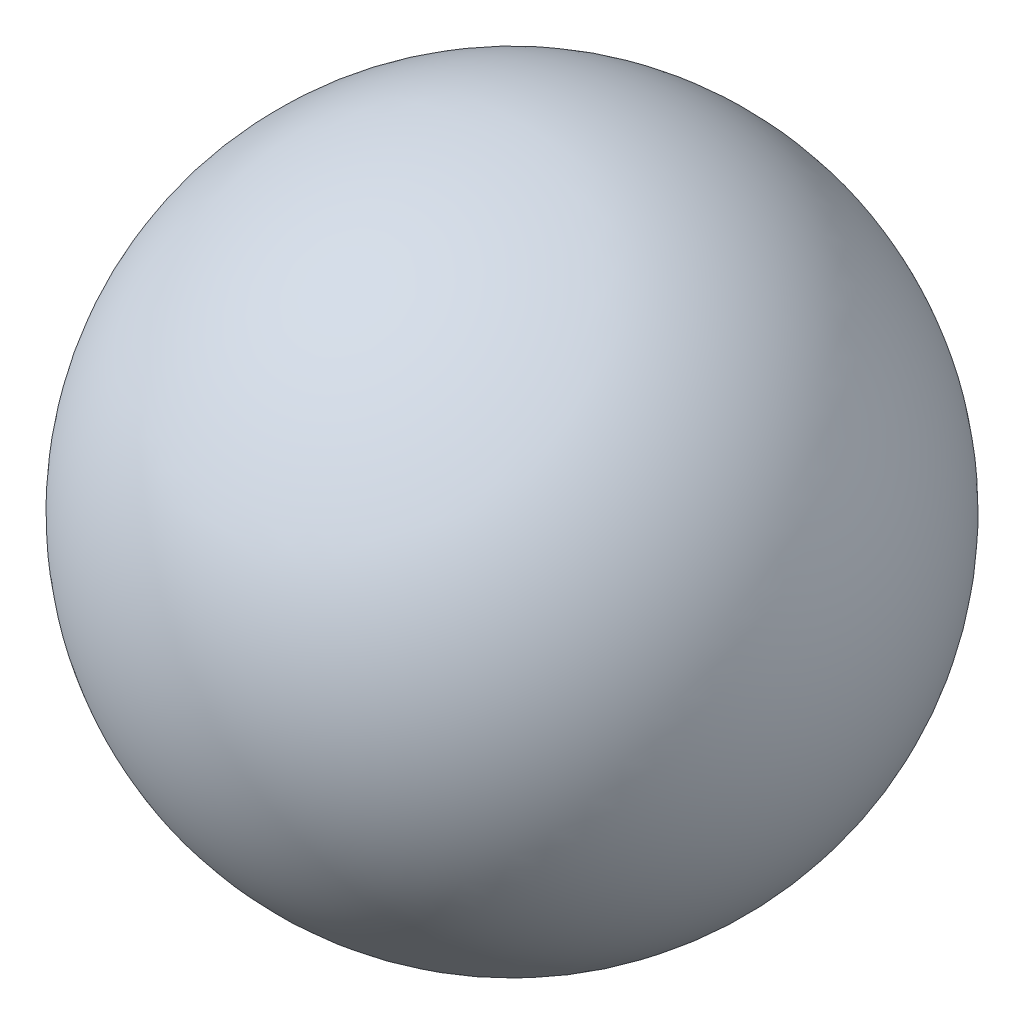
ISO-10303-21;
HEADER;
FILE_DESCRIPTION(('STEP AP214'),'2;1');
FILE_NAME('part.step','',(''),(''),'','','');
FILE_SCHEMA(('AUTOMOTIVE_DESIGN { 1 0 10303 214 1 1 1 1 }'));
ENDSEC;
DATA;
#1=APPLICATION_CONTEXT('core data for automotive mechanical design processes');
#2=APPLICATION_PROTOCOL_DEFINITION('international standard','automotive_design',2000,#1);
#3=PRODUCT_CONTEXT('',#1,'mechanical');
#4=PRODUCT('Part','Part','',(#3));
#5=PRODUCT_RELATED_PRODUCT_CATEGORY('part','',(#4));
#6=PRODUCT_DEFINITION_FORMATION('','',#4);
#7=PRODUCT_DEFINITION_CONTEXT('part definition',#1,'design');
#8=PRODUCT_DEFINITION('design','',#6,#7);
#9=PRODUCT_DEFINITION_SHAPE('','',#8);
#10=(LENGTH_UNIT() NAMED_UNIT(*) SI_UNIT(.MILLI.,.METRE.));
#11=(NAMED_UNIT(*) PLANE_ANGLE_UNIT() SI_UNIT($,.RADIAN.));
#12=(NAMED_UNIT(*) SI_UNIT($,.STERADIAN.) SOLID_ANGLE_UNIT());
#13=UNCERTAINTY_MEASURE_WITH_UNIT(LENGTH_MEASURE(1.E-05),#10,'distance_accuracy_value','');
#14=(GEOMETRIC_REPRESENTATION_CONTEXT(3) GLOBAL_UNCERTAINTY_ASSIGNED_CONTEXT((#13)) GLOBAL_UNIT_ASSIGNED_CONTEXT((#10,
#11,#12)) REPRESENTATION_CONTEXT('',''));
#15=CARTESIAN_POINT('',(0.,0.,0.));
#16=DIRECTION('',(0.,0.,1.));
#17=DIRECTION('',(1.,0.,0.));
#18=AXIS2_PLACEMENT_3D('',#15,#16,#17);
#19=CARTESIAN_POINT('',(11.630401942101,-2.,-1.67219934971108));
#20=DIRECTION('',(0.,0.,1.));
#21=DIRECTION('',(1.,0.,0.));
#22=AXIS2_PLACEMENT_3D('',#19,#20,#21);
#23=SPHERICAL_SURFACE('',#22,1.05);
#24=CARTESIAN_POINT('',(11.630401942101,-2.,-0.62219934971108));
#25=VERTEX_POINT('',#24);
#26=VERTEX_LOOP('',#25);
#27=FACE_BOUND('',#26,.T.);
#28=ADVANCED_FACE('F12',(#27),#23,.T.);
#29=CLOSED_SHELL('',(#28));
#30=MANIFOLD_SOLID_BREP('B1',#29);
#31=ADVANCED_BREP_SHAPE_REPRESENTATION('',(#18,#30),#14);
#32=SHAPE_DEFINITION_REPRESENTATION(#9,#31);
ENDSEC;
END-ISO-10303-21;
